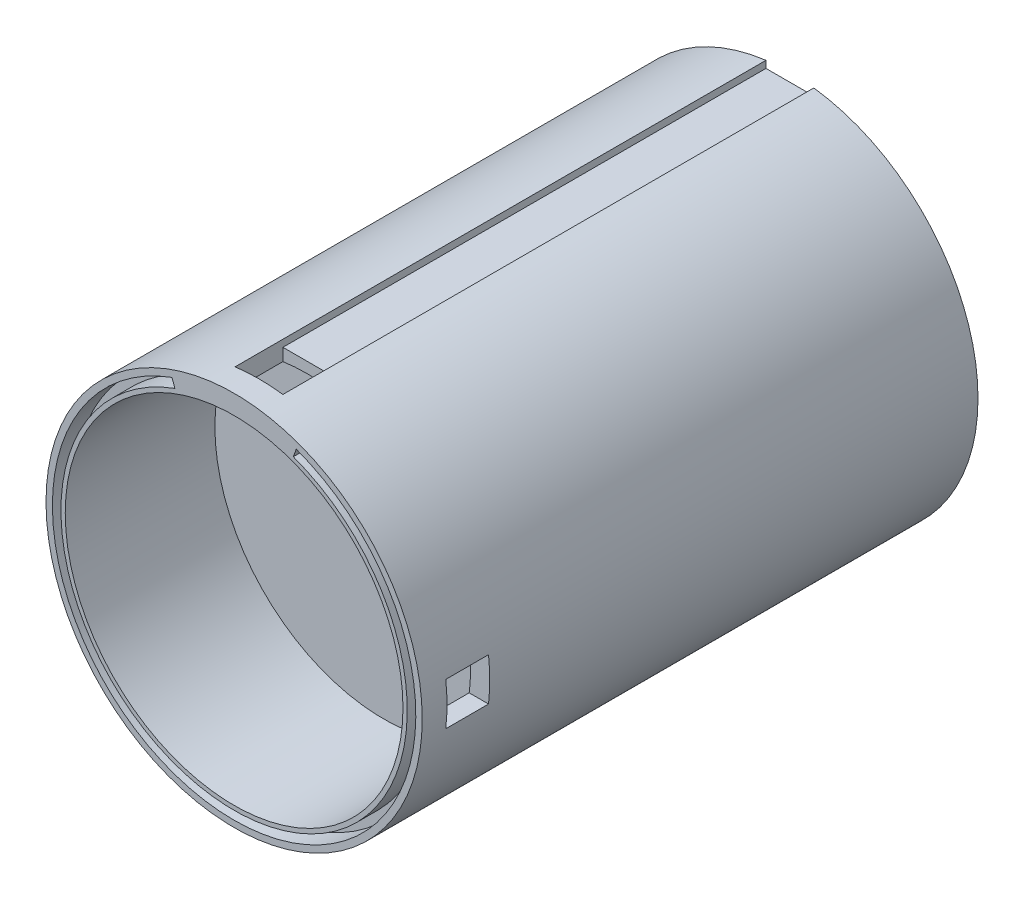
ISO-10303-21;
HEADER;
FILE_DESCRIPTION(('STEP AP214'),'2;1');
FILE_NAME('part.step','',(''),(''),'','','');
FILE_SCHEMA(('AUTOMOTIVE_DESIGN { 1 0 10303 214 1 1 1 1 }'));
ENDSEC;
DATA;
#1=APPLICATION_CONTEXT('core data for automotive mechanical design processes');
#2=APPLICATION_PROTOCOL_DEFINITION('international standard','automotive_design',2000,#1);
#3=PRODUCT_CONTEXT('',#1,'mechanical');
#4=PRODUCT('Part','Part','',(#3));
#5=PRODUCT_RELATED_PRODUCT_CATEGORY('part','',(#4));
#6=PRODUCT_DEFINITION_FORMATION('','',#4);
#7=PRODUCT_DEFINITION_CONTEXT('part definition',#1,'design');
#8=PRODUCT_DEFINITION('design','',#6,#7);
#9=PRODUCT_DEFINITION_SHAPE('','',#8);
#10=(LENGTH_UNIT() NAMED_UNIT(*) SI_UNIT(.MILLI.,.METRE.));
#11=(NAMED_UNIT(*) PLANE_ANGLE_UNIT() SI_UNIT($,.RADIAN.));
#12=(NAMED_UNIT(*) SI_UNIT($,.STERADIAN.) SOLID_ANGLE_UNIT());
#13=UNCERTAINTY_MEASURE_WITH_UNIT(LENGTH_MEASURE(1.E-05),#10,'distance_accuracy_value','');
#14=(GEOMETRIC_REPRESENTATION_CONTEXT(3) GLOBAL_UNCERTAINTY_ASSIGNED_CONTEXT((#13)) GLOBAL_UNIT_ASSIGNED_CONTEXT((#10,
#11,#12)) REPRESENTATION_CONTEXT('',''));
#15=CARTESIAN_POINT('',(0.,0.,0.));
#16=DIRECTION('',(0.,0.,1.));
#17=DIRECTION('',(1.,0.,0.));
#18=AXIS2_PLACEMENT_3D('',#15,#16,#17);
#19=CARTESIAN_POINT('',(0.,0.,130.));
#20=DIRECTION('',(0.,0.,1.));
#21=DIRECTION('',(1.,0.,0.));
#22=AXIS2_PLACEMENT_3D('',#19,#20,#21);
#23=PLANE('',#22);
#24=CARTESIAN_POINT('',(0.,0.,130.));
#25=DIRECTION('',(0.,0.,1.));
#26=DIRECTION('',(1.,0.,0.));
#27=AXIS2_PLACEMENT_3D('',#24,#25,#26);
#28=CIRCLE('',#27,39.5);
#29=CARTESIAN_POINT('',(39.5,0.,130.));
#30=VERTEX_POINT('',#29);
#31=EDGE_CURVE('E283',#30,#30,#28,.T.);
#32=ORIENTED_EDGE('',*,*,#31,.F.);
#33=EDGE_LOOP('',(#32));
#34=FACE_BOUND('',#33,.T.);
#35=CARTESIAN_POINT('',(0.,0.,130.));
#36=DIRECTION('',(0.,0.,1.));
#37=DIRECTION('',(1.,0.,0.));
#38=AXIS2_PLACEMENT_3D('',#35,#36,#37);
#39=CIRCLE('',#38,44.);
#40=CARTESIAN_POINT('',(44.,0.,130.));
#41=VERTEX_POINT('',#40);
#42=EDGE_CURVE('E296',#41,#41,#39,.T.);
#43=ORIENTED_EDGE('',*,*,#42,.T.);
#44=EDGE_LOOP('',(#43));
#45=FACE_BOUND('',#44,.T.);
#46=DIRECTION('',(0.342020143325669,-0.939692620785908,0.));
#47=VECTOR('',#46,1.);
#48=CARTESIAN_POINT('',(-14.535856091341,39.9369363834011,130.));
#49=LINE('',#48,#47);
#50=CARTESIAN_POINT('',(-14.535856091341,39.9369363834011,130.));
#51=VERTEX_POINT('',#50);
#52=CARTESIAN_POINT('',(-13.8518158046896,38.0575511418293,130.));
#53=VERTEX_POINT('',#52);
#54=EDGE_CURVE('E188',#51,#53,#49,.T.);
#55=ORIENTED_EDGE('',*,*,#54,.T.);
#56=CARTESIAN_POINT('',(0.,0.,130.));
#57=DIRECTION('',(0.,0.,1.));
#58=DIRECTION('',(-1.,0.,0.));
#59=AXIS2_PLACEMENT_3D('',#56,#57,#58);
#60=CIRCLE('',#59,40.5);
#61=CARTESIAN_POINT('',(13.8518158046896,38.0575511418293,130.));
#62=VERTEX_POINT('',#61);
#63=EDGE_CURVE('E49',#53,#62,#60,.T.);
#64=ORIENTED_EDGE('',*,*,#63,.T.);
#65=DIRECTION('',(0.34202014332567,0.939692620785908,0.));
#66=VECTOR('',#65,1.);
#67=CARTESIAN_POINT('',(14.535856091341,39.9369363834011,130.));
#68=LINE('',#67,#66);
#69=CARTESIAN_POINT('',(14.535856091341,39.9369363834011,130.));
#70=VERTEX_POINT('',#69);
#71=EDGE_CURVE('E179',#62,#70,#68,.T.);
#72=ORIENTED_EDGE('',*,*,#71,.T.);
#73=CARTESIAN_POINT('',(0.,0.,130.));
#74=DIRECTION('',(0.,0.,-1.));
#75=DIRECTION('',(-1.,0.,0.));
#76=AXIS2_PLACEMENT_3D('',#73,#74,#75);
#77=CIRCLE('',#76,42.5);
#78=EDGE_CURVE('E182',#70,#51,#77,.T.);
#79=ORIENTED_EDGE('',*,*,#78,.T.);
#80=EDGE_LOOP('',(#55,#64,#72,#79));
#81=FACE_BOUND('',#80,.T.);
#82=ADVANCED_FACE('F34',(#34,#45,#81),#23,.T.);
#83=CARTESIAN_POINT('',(0.,0.,130.));
#84=DIRECTION('',(0.,0.,-1.));
#85=DIRECTION('',(-1.,0.,0.));
#86=AXIS2_PLACEMENT_3D('',#83,#84,#85);
#87=CYLINDRICAL_SURFACE('',#86,44.);
#88=DIRECTION('',(0.,0.,-1.));
#89=VECTOR('',#88,1.);
#90=CARTESIAN_POINT('',(43.7149859887888,-5.,130.));
#91=LINE('',#90,#89);
#92=CARTESIAN_POINT('',(43.7149859887888,-5.,114.2));
#93=VERTEX_POINT('',#92);
#94=CARTESIAN_POINT('',(43.7149859887888,-5.,124.2));
#95=VERTEX_POINT('',#94);
#96=EDGE_CURVE('E200',#93,#95,#91,.F.);
#97=ORIENTED_EDGE('',*,*,#96,.T.);
#98=CARTESIAN_POINT('',(0.,0.,124.2));
#99=DIRECTION('',(0.,0.,1.));
#100=DIRECTION('',(1.,0.,0.));
#101=AXIS2_PLACEMENT_3D('',#98,#99,#100);
#102=CIRCLE('',#101,44.);
#103=CARTESIAN_POINT('',(43.7149859887888,5.,124.2));
#104=VERTEX_POINT('',#103);
#105=EDGE_CURVE('E216',#95,#104,#102,.T.);
#106=ORIENTED_EDGE('',*,*,#105,.T.);
#107=DIRECTION('',(0.,0.,-1.));
#108=VECTOR('',#107,1.);
#109=CARTESIAN_POINT('',(43.7149859887888,5.,130.));
#110=LINE('',#109,#108);
#111=CARTESIAN_POINT('',(43.7149859887888,5.,114.2));
#112=VERTEX_POINT('',#111);
#113=EDGE_CURVE('E213',#104,#112,#110,.T.);
#114=ORIENTED_EDGE('',*,*,#113,.T.);
#115=CARTESIAN_POINT('',(0.,0.,114.2));
#116=DIRECTION('',(0.,0.,-1.));
#117=DIRECTION('',(-1.,0.,0.));
#118=AXIS2_PLACEMENT_3D('',#115,#116,#117);
#119=CIRCLE('',#118,44.);
#120=EDGE_CURVE('E210',#112,#93,#119,.T.);
#121=ORIENTED_EDGE('',*,*,#120,.T.);
#122=EDGE_LOOP('',(#97,#106,#114,#121));
#123=FACE_BOUND('',#122,.T.);
#124=ORIENTED_EDGE('',*,*,#42,.F.);
#125=EDGE_LOOP('',(#124));
#126=FACE_BOUND('',#125,.T.);
#127=DIRECTION('',(0.,0.,-1.));
#128=VECTOR('',#127,1.);
#129=CARTESIAN_POINT('',(-5.59657094357997,43.6426212970014,130.));
#130=LINE('',#129,#128);
#131=CARTESIAN_POINT('',(-5.59657094357996,43.6426212970014,0.));
#132=VERTEX_POINT('',#131);
#133=CARTESIAN_POINT('',(-5.59657094357997,43.6426212970014,124.178374033125));
#134=VERTEX_POINT('',#133);
#135=EDGE_CURVE('E281',#132,#134,#130,.F.);
#136=ORIENTED_EDGE('',*,*,#135,.F.);
#137=CARTESIAN_POINT('',(0.,0.,0.));
#138=DIRECTION('',(0.,0.,1.));
#139=DIRECTION('',(1.,0.,0.));
#140=AXIS2_PLACEMENT_3D('',#137,#138,#139);
#141=CIRCLE('',#140,44.);
#142=CARTESIAN_POINT('',(5.59657094357996,43.6426212970014,0.));
#143=VERTEX_POINT('',#142);
#144=EDGE_CURVE('E293',#132,#143,#141,.T.);
#145=ORIENTED_EDGE('',*,*,#144,.T.);
#146=DIRECTION('',(0.,0.,-1.));
#147=VECTOR('',#146,1.);
#148=CARTESIAN_POINT('',(5.59657094357995,43.6426212970014,130.));
#149=LINE('',#148,#147);
#150=CARTESIAN_POINT('',(5.59657094357995,43.6426212970014,124.178374033125));
#151=VERTEX_POINT('',#150);
#152=EDGE_CURVE('E279',#151,#143,#149,.T.);
#153=ORIENTED_EDGE('',*,*,#152,.F.);
#154=CARTESIAN_POINT('',(0.,0.,124.178374033125));
#155=DIRECTION('',(0.,0.,-1.));
#156=DIRECTION('',(-1.,0.,0.));
#157=AXIS2_PLACEMENT_3D('',#154,#155,#156);
#158=CIRCLE('',#157,44.);
#159=EDGE_CURVE('E309',#134,#151,#158,.T.);
#160=ORIENTED_EDGE('',*,*,#159,.F.);
#161=EDGE_LOOP('',(#136,#145,#153,#160));
#162=FACE_BOUND('',#161,.T.);
#163=ADVANCED_FACE('F36',(#123,#126,#162),#87,.T.);
#164=CARTESIAN_POINT('',(0.,0.,0.));
#165=DIRECTION('',(0.,0.,1.));
#166=DIRECTION('',(1.,0.,0.));
#167=AXIS2_PLACEMENT_3D('',#164,#165,#166);
#168=PLANE('',#167);
#169=DIRECTION('',(0.34202014332567,0.939692620785908,0.));
#170=VECTOR('',#169,1.);
#171=CARTESIAN_POINT('',(14.535856091341,39.9369363834011,0.));
#172=LINE('',#171,#170);
#173=CARTESIAN_POINT('',(13.8518158046896,38.0575511418293,0.));
#174=VERTEX_POINT('',#173);
#175=CARTESIAN_POINT('',(14.535856091341,39.9369363834011,0.));
#176=VERTEX_POINT('',#175);
#177=EDGE_CURVE('E235',#174,#176,#172,.T.);
#178=ORIENTED_EDGE('',*,*,#177,.F.);
#179=CARTESIAN_POINT('',(0.,0.,0.));
#180=DIRECTION('',(0.,0.,1.));
#181=DIRECTION('',(-1.,0.,0.));
#182=AXIS2_PLACEMENT_3D('',#179,#180,#181);
#183=CIRCLE('',#182,40.5);
#184=CARTESIAN_POINT('',(-13.8518158046896,38.0575511418293,0.));
#185=VERTEX_POINT('',#184);
#186=EDGE_CURVE('E219',#185,#174,#183,.T.);
#187=ORIENTED_EDGE('',*,*,#186,.F.);
#188=DIRECTION('',(0.342020143325669,-0.939692620785908,0.));
#189=VECTOR('',#188,1.);
#190=CARTESIAN_POINT('',(-14.535856091341,39.9369363834011,0.));
#191=LINE('',#190,#189);
#192=CARTESIAN_POINT('',(-14.535856091341,39.9369363834011,0.));
#193=VERTEX_POINT('',#192);
#194=EDGE_CURVE('E224',#193,#185,#191,.T.);
#195=ORIENTED_EDGE('',*,*,#194,.F.);
#196=CARTESIAN_POINT('',(0.,0.,0.));
#197=DIRECTION('',(0.,0.,-1.));
#198=DIRECTION('',(-1.,0.,0.));
#199=AXIS2_PLACEMENT_3D('',#196,#197,#198);
#200=CIRCLE('',#199,42.5);
#201=EDGE_CURVE('E238',#176,#193,#200,.T.);
#202=ORIENTED_EDGE('',*,*,#201,.F.);
#203=EDGE_LOOP('',(#178,#187,#195,#202));
#204=FACE_BOUND('',#203,.T.);
#205=CARTESIAN_POINT('',(0.,0.,0.));
#206=DIRECTION('',(0.,0.,-1.));
#207=DIRECTION('',(-1.,0.,0.));
#208=AXIS2_PLACEMENT_3D('',#205,#206,#207);
#209=CIRCLE('',#208,39.5);
#210=CARTESIAN_POINT('',(-39.5,0.,0.));
#211=VERTEX_POINT('',#210);
#212=EDGE_CURVE('E287',#211,#211,#209,.T.);
#213=ORIENTED_EDGE('',*,*,#212,.F.);
#214=EDGE_LOOP('',(#213));
#215=FACE_BOUND('',#214,.T.);
#216=DIRECTION('',(0.,1.,0.));
#217=VECTOR('',#216,1.);
#218=CARTESIAN_POINT('',(-5.59657094357996,0.,0.));
#219=LINE('',#218,#217);
#220=CARTESIAN_POINT('',(-5.59657094357996,42.,0.));
#221=VERTEX_POINT('',#220);
#222=EDGE_CURVE('E307',#221,#132,#219,.T.);
#223=ORIENTED_EDGE('',*,*,#222,.F.);
#224=DIRECTION('',(1.,0.,0.));
#225=VECTOR('',#224,1.);
#226=CARTESIAN_POINT('',(0.,42.,0.));
#227=LINE('',#226,#225);
#228=CARTESIAN_POINT('',(5.59657094357996,42.,0.));
#229=VERTEX_POINT('',#228);
#230=EDGE_CURVE('E299',#221,#229,#227,.T.);
#231=ORIENTED_EDGE('',*,*,#230,.T.);
#232=DIRECTION('',(0.,-1.,0.));
#233=VECTOR('',#232,1.);
#234=CARTESIAN_POINT('',(5.59657094357996,0.,0.));
#235=LINE('',#234,#233);
#236=EDGE_CURVE('E304',#143,#229,#235,.T.);
#237=ORIENTED_EDGE('',*,*,#236,.F.);
#238=ORIENTED_EDGE('',*,*,#144,.F.);
#239=EDGE_LOOP('',(#223,#231,#237,#238));
#240=FACE_BOUND('',#239,.T.);
#241=ADVANCED_FACE('F349',(#204,#215,#240),#168,.F.);
#242=CARTESIAN_POINT('',(0.,0.,90.));
#243=DIRECTION('',(0.,0.,-1.));
#244=DIRECTION('',(-1.,0.,0.));
#245=AXIS2_PLACEMENT_3D('',#242,#243,#244);
#246=CYLINDRICAL_SURFACE('',#245,39.5);
#247=CARTESIAN_POINT('',(0.,0.,90.));
#248=DIRECTION('',(0.,0.,-1.));
#249=DIRECTION('',(-1.,0.,0.));
#250=AXIS2_PLACEMENT_3D('',#247,#248,#249);
#251=CIRCLE('',#250,39.5);
#252=CARTESIAN_POINT('',(-39.5,0.,90.));
#253=VERTEX_POINT('',#252);
#254=EDGE_CURVE('E290',#253,#253,#251,.T.);
#255=ORIENTED_EDGE('',*,*,#254,.F.);
#256=EDGE_LOOP('',(#255));
#257=FACE_BOUND('',#256,.T.);
#258=ORIENTED_EDGE('',*,*,#212,.T.);
#259=EDGE_LOOP('',(#258));
#260=FACE_BOUND('',#259,.T.);
#261=ADVANCED_FACE('F353',(#257,#260),#246,.F.);
#262=CARTESIAN_POINT('',(0.,0.,90.));
#263=DIRECTION('',(0.,0.,-1.));
#264=DIRECTION('',(-1.,0.,0.));
#265=AXIS2_PLACEMENT_3D('',#262,#263,#264);
#266=PLANE('',#265);
#267=ORIENTED_EDGE('',*,*,#254,.T.);
#268=EDGE_LOOP('',(#267));
#269=FACE_BOUND('',#268,.T.);
#270=ADVANCED_FACE('F360',(#269),#266,.T.);
#271=CARTESIAN_POINT('',(0.,0.,95.));
#272=DIRECTION('',(0.,0.,1.));
#273=DIRECTION('',(1.,0.,0.));
#274=AXIS2_PLACEMENT_3D('',#271,#272,#273);
#275=CYLINDRICAL_SURFACE('',#274,39.5);
#276=DIRECTION('',(0.,0.,1.));
#277=VECTOR('',#276,1.);
#278=CARTESIAN_POINT('',(39.1822663969301,5.,95.));
#279=LINE('',#278,#277);
#280=CARTESIAN_POINT('',(39.1822663969301,5.,114.2));
#281=VERTEX_POINT('',#280);
#282=CARTESIAN_POINT('',(39.1822663969301,5.,124.2));
#283=VERTEX_POINT('',#282);
#284=EDGE_CURVE('E42',#281,#283,#279,.T.);
#285=ORIENTED_EDGE('',*,*,#284,.T.);
#286=CARTESIAN_POINT('',(0.,0.,124.2));
#287=DIRECTION('',(0.,0.,1.));
#288=DIRECTION('',(1.,0.,0.));
#289=AXIS2_PLACEMENT_3D('',#286,#287,#288);
#290=CIRCLE('',#289,39.5);
#291=CARTESIAN_POINT('',(39.1822663969301,-5.,124.2));
#292=VERTEX_POINT('',#291);
#293=EDGE_CURVE('E11',#283,#292,#290,.F.);
#294=ORIENTED_EDGE('',*,*,#293,.T.);
#295=DIRECTION('',(0.,0.,1.));
#296=VECTOR('',#295,1.);
#297=CARTESIAN_POINT('',(39.1822663969301,-5.,95.));
#298=LINE('',#297,#296);
#299=CARTESIAN_POINT('',(39.1822663969301,-5.,114.2));
#300=VERTEX_POINT('',#299);
#301=EDGE_CURVE('E311',#292,#300,#298,.F.);
#302=ORIENTED_EDGE('',*,*,#301,.T.);
#303=CARTESIAN_POINT('',(0.,0.,114.2));
#304=DIRECTION('',(0.,0.,-1.));
#305=DIRECTION('',(-1.,0.,0.));
#306=AXIS2_PLACEMENT_3D('',#303,#304,#305);
#307=CIRCLE('',#306,39.5);
#308=EDGE_CURVE('E314',#300,#281,#307,.F.);
#309=ORIENTED_EDGE('',*,*,#308,.T.);
#310=EDGE_LOOP('',(#285,#294,#302,#309));
#311=FACE_BOUND('',#310,.T.);
#312=CARTESIAN_POINT('',(0.,0.,112.985232145965));
#313=DIRECTION('',(0.,0.,-1.));
#314=DIRECTION('',(-1.,0.,0.));
#315=AXIS2_PLACEMENT_3D('',#312,#313,#314);
#316=CIRCLE('',#315,39.5);
#317=CARTESIAN_POINT('',(5.59657094357995,39.1015139562841,112.985232145965));
#318=VERTEX_POINT('',#317);
#319=CARTESIAN_POINT('',(-5.59657094357997,39.1015139562841,112.985232145965));
#320=VERTEX_POINT('',#319);
#321=EDGE_CURVE('E264',#318,#320,#316,.F.);
#322=ORIENTED_EDGE('',*,*,#321,.T.);
#323=DIRECTION('',(0.,0.,1.));
#324=VECTOR('',#323,1.);
#325=CARTESIAN_POINT('',(-5.59657094357997,39.1015139562841,95.));
#326=LINE('',#325,#324);
#327=CARTESIAN_POINT('',(-5.59657094357997,39.1015139562841,124.178374033125));
#328=VERTEX_POINT('',#327);
#329=EDGE_CURVE('E267',#320,#328,#326,.T.);
#330=ORIENTED_EDGE('',*,*,#329,.T.);
#331=CARTESIAN_POINT('',(0.,0.,124.178374033125));
#332=DIRECTION('',(0.,0.,1.));
#333=DIRECTION('',(1.,0.,0.));
#334=AXIS2_PLACEMENT_3D('',#331,#332,#333);
#335=CIRCLE('',#334,39.5);
#336=CARTESIAN_POINT('',(5.59657094357995,39.1015139562841,124.178374033125));
#337=VERTEX_POINT('',#336);
#338=EDGE_CURVE('E257',#328,#337,#335,.F.);
#339=ORIENTED_EDGE('',*,*,#338,.T.);
#340=DIRECTION('',(0.,0.,1.));
#341=VECTOR('',#340,1.);
#342=CARTESIAN_POINT('',(5.59657094357995,39.1015139562841,95.));
#343=LINE('',#342,#341);
#344=EDGE_CURVE('E261',#337,#318,#343,.F.);
#345=ORIENTED_EDGE('',*,*,#344,.T.);
#346=EDGE_LOOP('',(#322,#330,#339,#345));
#347=FACE_BOUND('',#346,.T.);
#348=CARTESIAN_POINT('',(0.,0.,95.));
#349=DIRECTION('',(0.,0.,1.));
#350=DIRECTION('',(1.,0.,0.));
#351=AXIS2_PLACEMENT_3D('',#348,#349,#350);
#352=CIRCLE('',#351,39.5);
#353=CARTESIAN_POINT('',(39.5,0.,95.));
#354=VERTEX_POINT('',#353);
#355=EDGE_CURVE('E284',#354,#354,#352,.T.);
#356=ORIENTED_EDGE('',*,*,#355,.F.);
#357=EDGE_LOOP('',(#356));
#358=FACE_BOUND('',#357,.T.);
#359=ORIENTED_EDGE('',*,*,#31,.T.);
#360=EDGE_LOOP('',(#359));
#361=FACE_BOUND('',#360,.T.);
#362=ADVANCED_FACE('F318',(#311,#347,#358,#361),#275,.F.);
#363=CARTESIAN_POINT('',(0.,0.,95.));
#364=DIRECTION('',(0.,0.,1.));
#365=DIRECTION('',(1.,0.,0.));
#366=AXIS2_PLACEMENT_3D('',#363,#364,#365);
#367=PLANE('',#366);
#368=ORIENTED_EDGE('',*,*,#355,.T.);
#369=EDGE_LOOP('',(#368));
#370=FACE_BOUND('',#369,.T.);
#371=ADVANCED_FACE('F408',(#370),#367,.T.);
#372=CARTESIAN_POINT('',(-5.59657094357997,137.,124.178374033125));
#373=DIRECTION('',(0.,0.,-1.));
#374=DIRECTION('',(-1.,0.,0.));
#375=AXIS2_PLACEMENT_3D('',#372,#373,#374);
#376=PLANE('',#375);
#377=ORIENTED_EDGE('',*,*,#159,.T.);
#378=DIRECTION('',(0.,-1.,0.));
#379=VECTOR('',#378,1.);
#380=CARTESIAN_POINT('',(5.59657094357995,137.,124.178374033125));
#381=LINE('',#380,#379);
#382=EDGE_CURVE('E275',#151,#337,#381,.T.);
#383=ORIENTED_EDGE('',*,*,#382,.T.);
#384=ORIENTED_EDGE('',*,*,#338,.F.);
#385=DIRECTION('',(0.,-1.,0.));
#386=VECTOR('',#385,1.);
#387=CARTESIAN_POINT('',(-5.59657094357997,137.,124.178374033125));
#388=LINE('',#387,#386);
#389=EDGE_CURVE('E277',#134,#328,#388,.T.);
#390=ORIENTED_EDGE('',*,*,#389,.F.);
#391=EDGE_LOOP('',(#377,#383,#384,#390));
#392=FACE_BOUND('',#391,.T.);
#393=ADVANCED_FACE('F381',(#392),#376,.T.);
#394=CARTESIAN_POINT('',(-5.59657094357997,137.,124.178374033125));
#395=DIRECTION('',(1.,0.,0.));
#396=DIRECTION('',(0.,0.,-1.));
#397=AXIS2_PLACEMENT_3D('',#394,#395,#396);
#398=PLANE('',#397);
#399=ORIENTED_EDGE('',*,*,#135,.T.);
#400=ORIENTED_EDGE('',*,*,#389,.T.);
#401=ORIENTED_EDGE('',*,*,#329,.F.);
#402=DIRECTION('',(0.,1.,0.));
#403=VECTOR('',#402,1.);
#404=CARTESIAN_POINT('',(-5.59657094357997,17.,112.985232145965));
#405=LINE('',#404,#403);
#406=CARTESIAN_POINT('',(-5.59657094357997,42.,112.985232145965));
#407=VERTEX_POINT('',#406);
#408=EDGE_CURVE('E255',#320,#407,#405,.T.);
#409=ORIENTED_EDGE('',*,*,#408,.T.);
#410=DIRECTION('',(0.,0.,1.));
#411=VECTOR('',#410,1.);
#412=CARTESIAN_POINT('',(-5.59657094357997,42.,124.178374033125));
#413=LINE('',#412,#411);
#414=EDGE_CURVE('E270',#221,#407,#413,.T.);
#415=ORIENTED_EDGE('',*,*,#414,.F.);
#416=ORIENTED_EDGE('',*,*,#222,.T.);
#417=EDGE_LOOP('',(#399,#400,#401,#409,#415,#416));
#418=FACE_BOUND('',#417,.T.);
#419=ADVANCED_FACE('F374',(#418),#398,.T.);
#420=CARTESIAN_POINT('',(5.59657094357995,137.,124.178374033125));
#421=DIRECTION('',(-1.,0.,0.));
#422=DIRECTION('',(0.,0.,1.));
#423=AXIS2_PLACEMENT_3D('',#420,#421,#422);
#424=PLANE('',#423);
#425=ORIENTED_EDGE('',*,*,#152,.T.);
#426=ORIENTED_EDGE('',*,*,#236,.T.);
#427=DIRECTION('',(0.,0.,-1.));
#428=VECTOR('',#427,1.);
#429=CARTESIAN_POINT('',(5.59657094357995,42.,124.178374033125));
#430=LINE('',#429,#428);
#431=CARTESIAN_POINT('',(5.59657094357995,42.,112.985232145965));
#432=VERTEX_POINT('',#431);
#433=EDGE_CURVE('E273',#432,#229,#430,.T.);
#434=ORIENTED_EDGE('',*,*,#433,.F.);
#435=DIRECTION('',(0.,1.,0.));
#436=VECTOR('',#435,1.);
#437=CARTESIAN_POINT('',(5.59657094357995,17.,112.985232145965));
#438=LINE('',#437,#436);
#439=EDGE_CURVE('E254',#318,#432,#438,.T.);
#440=ORIENTED_EDGE('',*,*,#439,.F.);
#441=ORIENTED_EDGE('',*,*,#344,.F.);
#442=ORIENTED_EDGE('',*,*,#382,.F.);
#443=EDGE_LOOP('',(#425,#426,#434,#440,#441,#442));
#444=FACE_BOUND('',#443,.T.);
#445=ADVANCED_FACE('F385',(#444),#424,.T.);
#446=CARTESIAN_POINT('',(0.,42.,0.));
#447=DIRECTION('',(0.,-1.,0.));
#448=DIRECTION('',(0.,0.,-1.));
#449=AXIS2_PLACEMENT_3D('',#446,#447,#448);
#450=PLANE('',#449);
#451=ORIENTED_EDGE('',*,*,#414,.T.);
#452=DIRECTION('',(-1.,0.,0.));
#453=VECTOR('',#452,1.);
#454=CARTESIAN_POINT('',(-5.59657094357997,42.,112.985232145965));
#455=LINE('',#454,#453);
#456=EDGE_CURVE('E245',#432,#407,#455,.T.);
#457=ORIENTED_EDGE('',*,*,#456,.F.);
#458=ORIENTED_EDGE('',*,*,#433,.T.);
#459=ORIENTED_EDGE('',*,*,#230,.F.);
#460=EDGE_LOOP('',(#451,#457,#458,#459));
#461=FACE_BOUND('',#460,.T.);
#462=ADVANCED_FACE('F394',(#461),#450,.F.);
#463=CARTESIAN_POINT('',(-5.59657094357997,17.,112.985232145965));
#464=DIRECTION('',(0.,0.,-1.));
#465=DIRECTION('',(-1.,0.,0.));
#466=AXIS2_PLACEMENT_3D('',#463,#464,#465);
#467=PLANE('',#466);
#468=ORIENTED_EDGE('',*,*,#439,.T.);
#469=ORIENTED_EDGE('',*,*,#456,.T.);
#470=ORIENTED_EDGE('',*,*,#408,.F.);
#471=ORIENTED_EDGE('',*,*,#321,.F.);
#472=EDGE_LOOP('',(#468,#469,#470,#471));
#473=FACE_BOUND('',#472,.T.);
#474=ADVANCED_FACE('F391',(#473),#467,.F.);
#475=CARTESIAN_POINT('',(0.,0.,5.00000000000001));
#476=DIRECTION('',(0.,0.,-1.));
#477=DIRECTION('',(-1.,0.,0.));
#478=AXIS2_PLACEMENT_3D('',#475,#476,#477);
#479=CYLINDRICAL_SURFACE('',#478,40.5);
#480=ORIENTED_EDGE('',*,*,#186,.T.);
#481=DIRECTION('',(0.,0.,-1.));
#482=VECTOR('',#481,1.);
#483=CARTESIAN_POINT('',(13.8518158046896,38.0575511418293,5.00000000000001));
#484=LINE('',#483,#482);
#485=CARTESIAN_POINT('',(13.8518158046896,38.0575511418293,5.00000000000001));
#486=VERTEX_POINT('',#485);
#487=EDGE_CURVE('E233',#486,#174,#484,.T.);
#488=ORIENTED_EDGE('',*,*,#487,.F.);
#489=CARTESIAN_POINT('',(0.,0.,5.00000000000001));
#490=DIRECTION('',(0.,0.,1.));
#491=DIRECTION('',(-1.,0.,0.));
#492=AXIS2_PLACEMENT_3D('',#489,#490,#491);
#493=CIRCLE('',#492,40.5);
#494=CARTESIAN_POINT('',(-13.8518158046896,38.0575511418293,5.00000000000001));
#495=VERTEX_POINT('',#494);
#496=EDGE_CURVE('E220',#495,#486,#493,.T.);
#497=ORIENTED_EDGE('',*,*,#496,.F.);
#498=DIRECTION('',(0.,0.,-1.));
#499=VECTOR('',#498,1.);
#500=CARTESIAN_POINT('',(-13.8518158046896,38.0575511418293,5.00000000000001));
#501=LINE('',#500,#499);
#502=EDGE_CURVE('E243',#495,#185,#501,.T.);
#503=ORIENTED_EDGE('',*,*,#502,.T.);
#504=EDGE_LOOP('',(#480,#488,#497,#503));
#505=FACE_BOUND('',#504,.T.);
#506=ADVANCED_FACE('F401',(#505),#479,.T.);
#507=CARTESIAN_POINT('',(-14.535856091341,39.9369363834011,5.00000000000001));
#508=DIRECTION('',(0.939692620785908,0.342020143325669,0.));
#509=DIRECTION('',(-0.342020143325669,0.939692620785908,0.));
#510=AXIS2_PLACEMENT_3D('',#507,#508,#509);
#511=PLANE('',#510);
#512=ORIENTED_EDGE('',*,*,#194,.T.);
#513=ORIENTED_EDGE('',*,*,#502,.F.);
#514=DIRECTION('',(0.342020143325669,-0.939692620785908,0.));
#515=VECTOR('',#514,1.);
#516=CARTESIAN_POINT('',(-14.535856091341,39.9369363834011,5.00000000000001));
#517=LINE('',#516,#515);
#518=CARTESIAN_POINT('',(-14.535856091341,39.9369363834011,5.00000000000001));
#519=VERTEX_POINT('',#518);
#520=EDGE_CURVE('E230',#519,#495,#517,.T.);
#521=ORIENTED_EDGE('',*,*,#520,.F.);
#522=DIRECTION('',(0.,0.,-1.));
#523=VECTOR('',#522,1.);
#524=CARTESIAN_POINT('',(-14.535856091341,39.9369363834011,5.00000000000001));
#525=LINE('',#524,#523);
#526=EDGE_CURVE('E246',#519,#193,#525,.T.);
#527=ORIENTED_EDGE('',*,*,#526,.T.);
#528=EDGE_LOOP('',(#512,#513,#521,#527));
#529=FACE_BOUND('',#528,.T.);
#530=ADVANCED_FACE('F469',(#529),#511,.F.);
#531=CARTESIAN_POINT('',(0.,0.,5.00000000000001));
#532=DIRECTION('',(0.,0.,-1.));
#533=DIRECTION('',(-1.,0.,0.));
#534=AXIS2_PLACEMENT_3D('',#531,#532,#533);
#535=CYLINDRICAL_SURFACE('',#534,42.5);
#536=ORIENTED_EDGE('',*,*,#201,.T.);
#537=ORIENTED_EDGE('',*,*,#526,.F.);
#538=CARTESIAN_POINT('',(0.,0.,5.00000000000001));
#539=DIRECTION('',(0.,0.,-1.));
#540=DIRECTION('',(-1.,0.,0.));
#541=AXIS2_PLACEMENT_3D('',#538,#539,#540);
#542=CIRCLE('',#541,42.5);
#543=CARTESIAN_POINT('',(14.535856091341,39.9369363834011,5.00000000000001));
#544=VERTEX_POINT('',#543);
#545=EDGE_CURVE('E227',#544,#519,#542,.T.);
#546=ORIENTED_EDGE('',*,*,#545,.F.);
#547=DIRECTION('',(0.,0.,-1.));
#548=VECTOR('',#547,1.);
#549=CARTESIAN_POINT('',(14.535856091341,39.9369363834011,5.00000000000001));
#550=LINE('',#549,#548);
#551=EDGE_CURVE('E248',#544,#176,#550,.T.);
#552=ORIENTED_EDGE('',*,*,#551,.T.);
#553=EDGE_LOOP('',(#536,#537,#546,#552));
#554=FACE_BOUND('',#553,.T.);
#555=ADVANCED_FACE('F478',(#554),#535,.F.);
#556=CARTESIAN_POINT('',(14.535856091341,39.9369363834011,5.00000000000001));
#557=DIRECTION('',(-0.939692620785908,0.34202014332567,0.));
#558=DIRECTION('',(-0.34202014332567,-0.939692620785908,0.));
#559=AXIS2_PLACEMENT_3D('',#556,#557,#558);
#560=PLANE('',#559);
#561=ORIENTED_EDGE('',*,*,#177,.T.);
#562=ORIENTED_EDGE('',*,*,#551,.F.);
#563=DIRECTION('',(0.34202014332567,0.939692620785908,0.));
#564=VECTOR('',#563,1.);
#565=CARTESIAN_POINT('',(14.535856091341,39.9369363834011,5.00000000000001));
#566=LINE('',#565,#564);
#567=EDGE_CURVE('E223',#486,#544,#566,.T.);
#568=ORIENTED_EDGE('',*,*,#567,.F.);
#569=ORIENTED_EDGE('',*,*,#487,.T.);
#570=EDGE_LOOP('',(#561,#562,#568,#569));
#571=FACE_BOUND('',#570,.T.);
#572=ADVANCED_FACE('F339',(#571),#560,.F.);
#573=CARTESIAN_POINT('',(0.,0.,5.00000000000001));
#574=DIRECTION('',(0.,0.,-1.));
#575=DIRECTION('',(-1.,0.,0.));
#576=AXIS2_PLACEMENT_3D('',#573,#574,#575);
#577=PLANE('',#576);
#578=ORIENTED_EDGE('',*,*,#496,.T.);
#579=ORIENTED_EDGE('',*,*,#567,.T.);
#580=ORIENTED_EDGE('',*,*,#545,.T.);
#581=ORIENTED_EDGE('',*,*,#520,.T.);
#582=EDGE_LOOP('',(#578,#579,#580,#581));
#583=FACE_BOUND('',#582,.T.);
#584=ADVANCED_FACE('F332',(#583),#577,.T.);
#585=CARTESIAN_POINT('',(35.,5.,124.2));
#586=DIRECTION('',(0.,0.,1.));
#587=DIRECTION('',(1.,0.,0.));
#588=AXIS2_PLACEMENT_3D('',#585,#586,#587);
#589=PLANE('',#588);
#590=DIRECTION('',(1.,0.,0.));
#591=VECTOR('',#590,1.);
#592=CARTESIAN_POINT('',(35.,-5.,124.2));
#593=LINE('',#592,#591);
#594=EDGE_CURVE('E57',#292,#95,#593,.T.);
#595=ORIENTED_EDGE('',*,*,#594,.F.);
#596=ORIENTED_EDGE('',*,*,#293,.F.);
#597=DIRECTION('',(1.,0.,0.));
#598=VECTOR('',#597,1.);
#599=CARTESIAN_POINT('',(35.,5.,124.2));
#600=LINE('',#599,#598);
#601=EDGE_CURVE('E197',#283,#104,#600,.T.);
#602=ORIENTED_EDGE('',*,*,#601,.T.);
#603=ORIENTED_EDGE('',*,*,#105,.F.);
#604=EDGE_LOOP('',(#595,#596,#602,#603));
#605=FACE_BOUND('',#604,.T.);
#606=ADVANCED_FACE('F330',(#605),#589,.F.);
#607=CARTESIAN_POINT('',(35.,5.,124.2));
#608=DIRECTION('',(0.,1.,0.));
#609=DIRECTION('',(0.,0.,1.));
#610=AXIS2_PLACEMENT_3D('',#607,#608,#609);
#611=PLANE('',#610);
#612=ORIENTED_EDGE('',*,*,#601,.F.);
#613=ORIENTED_EDGE('',*,*,#284,.F.);
#614=DIRECTION('',(1.,0.,0.));
#615=VECTOR('',#614,1.);
#616=CARTESIAN_POINT('',(35.,5.,114.2));
#617=LINE('',#616,#615);
#618=EDGE_CURVE('E201',#281,#112,#617,.T.);
#619=ORIENTED_EDGE('',*,*,#618,.T.);
#620=ORIENTED_EDGE('',*,*,#113,.F.);
#621=EDGE_LOOP('',(#612,#613,#619,#620));
#622=FACE_BOUND('',#621,.T.);
#623=ADVANCED_FACE('F324',(#622),#611,.F.);
#624=CARTESIAN_POINT('',(35.,5.,114.2));
#625=DIRECTION('',(0.,0.,-1.));
#626=DIRECTION('',(-1.,0.,0.));
#627=AXIS2_PLACEMENT_3D('',#624,#625,#626);
#628=PLANE('',#627);
#629=ORIENTED_EDGE('',*,*,#618,.F.);
#630=ORIENTED_EDGE('',*,*,#308,.F.);
#631=DIRECTION('',(1.,0.,0.));
#632=VECTOR('',#631,1.);
#633=CARTESIAN_POINT('',(35.,-5.,114.2));
#634=LINE('',#633,#632);
#635=EDGE_CURVE('E204',#300,#93,#634,.T.);
#636=ORIENTED_EDGE('',*,*,#635,.T.);
#637=ORIENTED_EDGE('',*,*,#120,.F.);
#638=EDGE_LOOP('',(#629,#630,#636,#637));
#639=FACE_BOUND('',#638,.T.);
#640=ADVANCED_FACE('F326',(#639),#628,.F.);
#641=CARTESIAN_POINT('',(35.,-5.,124.2));
#642=DIRECTION('',(0.,-1.,0.));
#643=DIRECTION('',(0.,0.,-1.));
#644=AXIS2_PLACEMENT_3D('',#641,#642,#643);
#645=PLANE('',#644);
#646=ORIENTED_EDGE('',*,*,#635,.F.);
#647=ORIENTED_EDGE('',*,*,#301,.F.);
#648=ORIENTED_EDGE('',*,*,#594,.T.);
#649=ORIENTED_EDGE('',*,*,#96,.F.);
#650=EDGE_LOOP('',(#646,#647,#648,#649));
#651=FACE_BOUND('',#650,.T.);
#652=ADVANCED_FACE('F543',(#651),#645,.F.);
#653=CARTESIAN_POINT('',(0.,0.,125.));
#654=DIRECTION('',(0.,0.,1.));
#655=DIRECTION('',(1.,0.,0.));
#656=AXIS2_PLACEMENT_3D('',#653,#654,#655);
#657=CYLINDRICAL_SURFACE('',#656,40.5);
#658=ORIENTED_EDGE('',*,*,#63,.F.);
#659=DIRECTION('',(0.,0.,1.));
#660=VECTOR('',#659,1.);
#661=CARTESIAN_POINT('',(-13.8518158046896,38.0575511418293,125.));
#662=LINE('',#661,#660);
#663=CARTESIAN_POINT('',(-13.8518158046896,38.0575511418293,125.));
#664=VERTEX_POINT('',#663);
#665=EDGE_CURVE('E164',#664,#53,#662,.T.);
#666=ORIENTED_EDGE('',*,*,#665,.F.);
#667=CARTESIAN_POINT('',(0.,0.,125.));
#668=DIRECTION('',(0.,0.,1.));
#669=DIRECTION('',(-1.,0.,0.));
#670=AXIS2_PLACEMENT_3D('',#667,#668,#669);
#671=CIRCLE('',#670,40.5);
#672=CARTESIAN_POINT('',(13.8518158046896,38.0575511418293,125.));
#673=VERTEX_POINT('',#672);
#674=EDGE_CURVE('E171',#664,#673,#671,.T.);
#675=ORIENTED_EDGE('',*,*,#674,.T.);
#676=DIRECTION('',(0.,0.,1.));
#677=VECTOR('',#676,1.);
#678=CARTESIAN_POINT('',(13.8518158046896,38.0575511418293,125.));
#679=LINE('',#678,#677);
#680=EDGE_CURVE('E192',#673,#62,#679,.T.);
#681=ORIENTED_EDGE('',*,*,#680,.T.);
#682=EDGE_LOOP('',(#658,#666,#675,#681));
#683=FACE_BOUND('',#682,.T.);
#684=ADVANCED_FACE('F174',(#683),#657,.T.);
#685=CARTESIAN_POINT('',(14.535856091341,39.9369363834011,125.));
#686=DIRECTION('',(0.939692620785908,-0.34202014332567,0.));
#687=DIRECTION('',(0.34202014332567,0.939692620785908,0.));
#688=AXIS2_PLACEMENT_3D('',#685,#686,#687);
#689=PLANE('',#688);
#690=ORIENTED_EDGE('',*,*,#71,.F.);
#691=ORIENTED_EDGE('',*,*,#680,.F.);
#692=DIRECTION('',(0.34202014332567,0.939692620785908,0.));
#693=VECTOR('',#692,1.);
#694=CARTESIAN_POINT('',(14.535856091341,39.9369363834011,125.));
#695=LINE('',#694,#693);
#696=CARTESIAN_POINT('',(14.535856091341,39.9369363834011,125.));
#697=VERTEX_POINT('',#696);
#698=EDGE_CURVE('E176',#673,#697,#695,.T.);
#699=ORIENTED_EDGE('',*,*,#698,.T.);
#700=DIRECTION('',(0.,0.,1.));
#701=VECTOR('',#700,1.);
#702=CARTESIAN_POINT('',(14.535856091341,39.9369363834011,125.));
#703=LINE('',#702,#701);
#704=EDGE_CURVE('E194',#697,#70,#703,.T.);
#705=ORIENTED_EDGE('',*,*,#704,.T.);
#706=EDGE_LOOP('',(#690,#691,#699,#705));
#707=FACE_BOUND('',#706,.T.);
#708=ADVANCED_FACE('F561',(#707),#689,.T.);
#709=CARTESIAN_POINT('',(0.,0.,125.));
#710=DIRECTION('',(0.,0.,1.));
#711=DIRECTION('',(1.,0.,0.));
#712=AXIS2_PLACEMENT_3D('',#709,#710,#711);
#713=CYLINDRICAL_SURFACE('',#712,42.5);
#714=ORIENTED_EDGE('',*,*,#78,.F.);
#715=ORIENTED_EDGE('',*,*,#704,.F.);
#716=CARTESIAN_POINT('',(0.,0.,125.));
#717=DIRECTION('',(0.,0.,-1.));
#718=DIRECTION('',(-1.,0.,0.));
#719=AXIS2_PLACEMENT_3D('',#716,#717,#718);
#720=CIRCLE('',#719,42.5);
#721=CARTESIAN_POINT('',(-14.535856091341,39.9369363834011,125.));
#722=VERTEX_POINT('',#721);
#723=EDGE_CURVE('E170',#697,#722,#720,.T.);
#724=ORIENTED_EDGE('',*,*,#723,.T.);
#725=DIRECTION('',(0.,0.,1.));
#726=VECTOR('',#725,1.);
#727=CARTESIAN_POINT('',(-14.535856091341,39.9369363834011,125.));
#728=LINE('',#727,#726);
#729=EDGE_CURVE('E166',#722,#51,#728,.T.);
#730=ORIENTED_EDGE('',*,*,#729,.T.);
#731=EDGE_LOOP('',(#714,#715,#724,#730));
#732=FACE_BOUND('',#731,.T.);
#733=ADVANCED_FACE('F569',(#732),#713,.F.);
#734=CARTESIAN_POINT('',(-14.535856091341,39.9369363834011,125.));
#735=DIRECTION('',(-0.939692620785908,-0.342020143325669,0.));
#736=DIRECTION('',(0.342020143325669,-0.939692620785908,0.));
#737=AXIS2_PLACEMENT_3D('',#734,#735,#736);
#738=PLANE('',#737);
#739=ORIENTED_EDGE('',*,*,#54,.F.);
#740=ORIENTED_EDGE('',*,*,#729,.F.);
#741=DIRECTION('',(0.342020143325669,-0.939692620785908,0.));
#742=VECTOR('',#741,1.);
#743=CARTESIAN_POINT('',(-14.535856091341,39.9369363834011,125.));
#744=LINE('',#743,#742);
#745=EDGE_CURVE('E161',#722,#664,#744,.T.);
#746=ORIENTED_EDGE('',*,*,#745,.T.);
#747=ORIENTED_EDGE('',*,*,#665,.T.);
#748=EDGE_LOOP('',(#739,#740,#746,#747));
#749=FACE_BOUND('',#748,.T.);
#750=ADVANCED_FACE('F163',(#749),#738,.T.);
#751=CARTESIAN_POINT('',(0.,0.,125.));
#752=DIRECTION('',(0.,0.,1.));
#753=DIRECTION('',(-1.,0.,0.));
#754=AXIS2_PLACEMENT_3D('',#751,#752,#753);
#755=PLANE('',#754);
#756=ORIENTED_EDGE('',*,*,#674,.F.);
#757=ORIENTED_EDGE('',*,*,#745,.F.);
#758=ORIENTED_EDGE('',*,*,#723,.F.);
#759=ORIENTED_EDGE('',*,*,#698,.F.);
#760=EDGE_LOOP('',(#756,#757,#758,#759));
#761=FACE_BOUND('',#760,.T.);
#762=ADVANCED_FACE('F178',(#761),#755,.T.);
#763=CLOSED_SHELL('',(#82,#163,#241,#261,#270,#362,#371,#393,#419,#445,#462,#474,#506,#530,#555,
#572,#584,#606,#623,#640,#652,#684,#708,#733,#750,#762));
#764=MANIFOLD_SOLID_BREP('B2',#763);
#765=ADVANCED_BREP_SHAPE_REPRESENTATION('',(#18,#764),#14);
#766=SHAPE_DEFINITION_REPRESENTATION(#9,#765);
ENDSEC;
END-ISO-10303-21;
